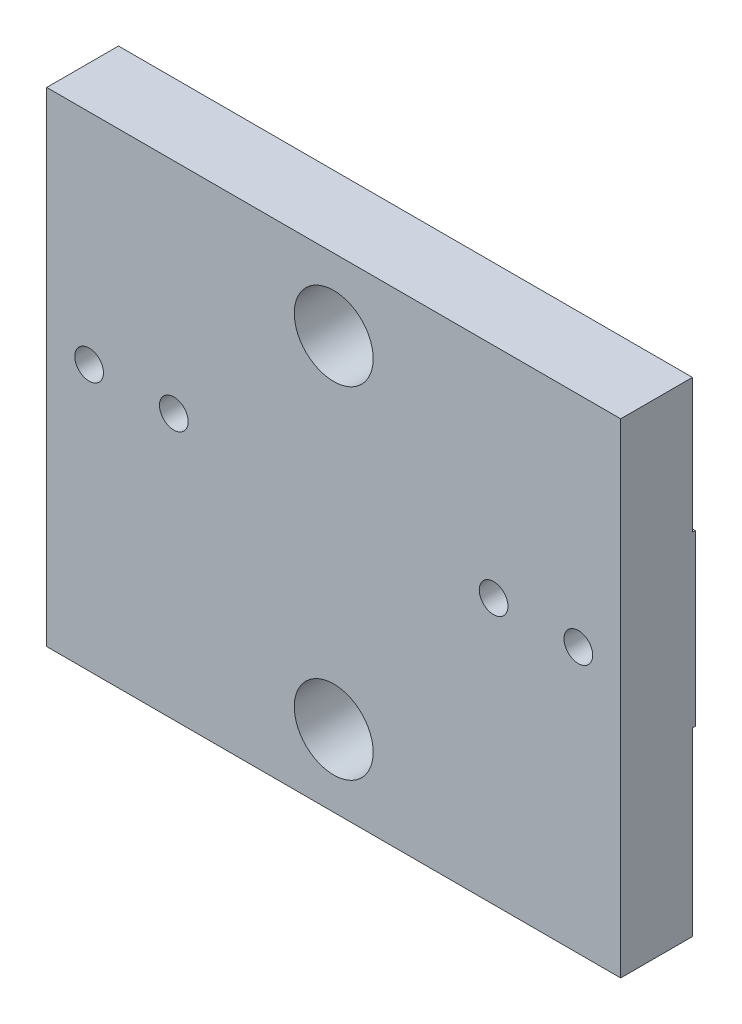
ISO-10303-21;
HEADER;
FILE_DESCRIPTION(('STEP AP214'),'2;1');
FILE_NAME('part.step','',(''),(''),'','','');
FILE_SCHEMA(('AUTOMOTIVE_DESIGN { 1 0 10303 214 1 1 1 1 }'));
ENDSEC;
DATA;
#1=APPLICATION_CONTEXT('core data for automotive mechanical design processes');
#2=APPLICATION_PROTOCOL_DEFINITION('international standard','automotive_design',2000,#1);
#3=PRODUCT_CONTEXT('',#1,'mechanical');
#4=PRODUCT('Part','Part','',(#3));
#5=PRODUCT_RELATED_PRODUCT_CATEGORY('part','',(#4));
#6=PRODUCT_DEFINITION_FORMATION('','',#4);
#7=PRODUCT_DEFINITION_CONTEXT('part definition',#1,'design');
#8=PRODUCT_DEFINITION('design','',#6,#7);
#9=PRODUCT_DEFINITION_SHAPE('','',#8);
#10=(LENGTH_UNIT() NAMED_UNIT(*) SI_UNIT(.MILLI.,.METRE.));
#11=(NAMED_UNIT(*) PLANE_ANGLE_UNIT() SI_UNIT($,.RADIAN.));
#12=(NAMED_UNIT(*) SI_UNIT($,.STERADIAN.) SOLID_ANGLE_UNIT());
#13=UNCERTAINTY_MEASURE_WITH_UNIT(LENGTH_MEASURE(1.E-05),#10,'distance_accuracy_value','');
#14=(GEOMETRIC_REPRESENTATION_CONTEXT(3) GLOBAL_UNCERTAINTY_ASSIGNED_CONTEXT((#13)) GLOBAL_UNIT_ASSIGNED_CONTEXT((#10,
#11,#12)) REPRESENTATION_CONTEXT('',''));
#15=CARTESIAN_POINT('',(0.,0.,0.));
#16=DIRECTION('',(0.,0.,1.));
#17=DIRECTION('',(1.,0.,0.));
#18=AXIS2_PLACEMENT_3D('',#15,#16,#17);
#19=CARTESIAN_POINT('',(0.,0.,0.));
#20=DIRECTION('',(0.,0.,-1.));
#21=DIRECTION('',(-1.,0.,0.));
#22=AXIS2_PLACEMENT_3D('',#19,#20,#21);
#23=PLANE('',#22);
#24=DIRECTION('',(1.,0.,0.));
#25=VECTOR('',#24,1.);
#26=CARTESIAN_POINT('',(-8.66,4.9255,0.));
#27=LINE('',#26,#25);
#28=CARTESIAN_POINT('',(-8.66,4.9255,0.));
#29=VERTEX_POINT('',#28);
#30=CARTESIAN_POINT('',(-7.16,4.9255,0.));
#31=VERTEX_POINT('',#30);
#32=EDGE_CURVE('E86',#29,#31,#27,.T.);
#33=ORIENTED_EDGE('',*,*,#32,.F.);
#34=DIRECTION('',(0.,1.,0.));
#35=VECTOR('',#34,1.);
#36=CARTESIAN_POINT('',(-8.66,4.5255,0.));
#37=LINE('',#36,#35);
#38=CARTESIAN_POINT('',(-8.66,4.5255,0.));
#39=VERTEX_POINT('',#38);
#40=EDGE_CURVE('E349',#39,#29,#37,.T.);
#41=ORIENTED_EDGE('',*,*,#40,.F.);
#42=DIRECTION('',(1.,0.,0.));
#43=VECTOR('',#42,1.);
#44=CARTESIAN_POINT('',(-8.66,4.5255,0.));
#45=LINE('',#44,#43);
#46=CARTESIAN_POINT('',(-7.16,4.5255,0.));
#47=VERTEX_POINT('',#46);
#48=EDGE_CURVE('E343',#39,#47,#45,.T.);
#49=ORIENTED_EDGE('',*,*,#48,.T.);
#50=DIRECTION('',(0.,1.,0.));
#51=VECTOR('',#50,1.);
#52=CARTESIAN_POINT('',(-7.16,4.5255,0.));
#53=LINE('',#52,#51);
#54=EDGE_CURVE('E345',#47,#31,#53,.T.);
#55=ORIENTED_EDGE('',*,*,#54,.T.);
#56=EDGE_LOOP('',(#33,#41,#49,#55));
#57=FACE_BOUND('',#56,.T.);
#58=CARTESIAN_POINT('',(-5.66,0.825500000000002,0.));
#59=DIRECTION('',(0.,0.,-1.));
#60=DIRECTION('',(-1.,0.,0.));
#61=AXIS2_PLACEMENT_3D('',#58,#59,#60);
#62=CIRCLE('',#61,1.008);
#63=CARTESIAN_POINT('',(-6.668,0.825500000000002,0.));
#64=VERTEX_POINT('',#63);
#65=EDGE_CURVE('E12',#64,#64,#62,.T.);
#66=ORIENTED_EDGE('',*,*,#65,.F.);
#67=EDGE_LOOP('',(#66));
#68=FACE_BOUND('',#67,.T.);
#69=CARTESIAN_POINT('',(5.66000000000001,0.825500000000005,0.));
#70=DIRECTION('',(0.,0.,-1.));
#71=DIRECTION('',(-1.,0.,0.));
#72=AXIS2_PLACEMENT_3D('',#69,#70,#71);
#73=CIRCLE('',#72,1.008);
#74=CARTESIAN_POINT('',(4.65200000000001,0.825500000000005,0.));
#75=VERTEX_POINT('',#74);
#76=EDGE_CURVE('E71',#75,#75,#73,.T.);
#77=ORIENTED_EDGE('',*,*,#76,.F.);
#78=EDGE_LOOP('',(#77));
#79=FACE_BOUND('',#78,.T.);
#80=CARTESIAN_POINT('',(0.,-6.0325,0.));
#81=DIRECTION('',(0.,0.,1.));
#82=DIRECTION('',(1.,0.,0.));
#83=AXIS2_PLACEMENT_3D('',#80,#81,#82);
#84=CIRCLE('',#83,1.397);
#85=CARTESIAN_POINT('',(1.397,-6.0325,0.));
#86=VERTEX_POINT('',#85);
#87=EDGE_CURVE('E490',#86,#86,#84,.T.);
#88=ORIENTED_EDGE('',*,*,#87,.T.);
#89=EDGE_LOOP('',(#88));
#90=FACE_BOUND('',#89,.T.);
#91=CARTESIAN_POINT('',(0.,6.0325,0.));
#92=DIRECTION('',(0.,0.,1.));
#93=DIRECTION('',(1.,0.,0.));
#94=AXIS2_PLACEMENT_3D('',#91,#92,#93);
#95=CIRCLE('',#94,1.397);
#96=CARTESIAN_POINT('',(1.397,6.0325,0.));
#97=VERTEX_POINT('',#96);
#98=EDGE_CURVE('E496',#97,#97,#95,.T.);
#99=ORIENTED_EDGE('',*,*,#98,.T.);
#100=EDGE_LOOP('',(#99));
#101=FACE_BOUND('',#100,.T.);
#102=DIRECTION('',(0.,-1.,0.));
#103=VECTOR('',#102,1.);
#104=CARTESIAN_POINT('',(-7.16,0.,0.));
#105=LINE('',#104,#103);
#106=CARTESIAN_POINT('',(-7.16,3.8255,0.));
#107=VERTEX_POINT('',#106);
#108=CARTESIAN_POINT('',(-7.16,-2.1745,0.));
#109=VERTEX_POINT('',#108);
#110=EDGE_CURVE('E386',#107,#109,#105,.T.);
#111=ORIENTED_EDGE('',*,*,#110,.F.);
#112=DIRECTION('',(1.,0.,0.));
#113=VECTOR('',#112,1.);
#114=CARTESIAN_POINT('',(0.,3.8255,0.));
#115=LINE('',#114,#113);
#116=CARTESIAN_POINT('',(-10.16,3.8255,0.));
#117=VERTEX_POINT('',#116);
#118=EDGE_CURVE('E384',#117,#107,#115,.T.);
#119=ORIENTED_EDGE('',*,*,#118,.F.);
#120=DIRECTION('',(0.,-1.,0.));
#121=VECTOR('',#120,1.);
#122=CARTESIAN_POINT('',(-10.16,-8.5725,0.));
#123=LINE('',#122,#121);
#124=CARTESIAN_POINT('',(-10.16,8.5725,0.));
#125=VERTEX_POINT('',#124);
#126=EDGE_CURVE('E477',#125,#117,#123,.T.);
#127=ORIENTED_EDGE('',*,*,#126,.F.);
#128=DIRECTION('',(-1.,0.,0.));
#129=VECTOR('',#128,1.);
#130=CARTESIAN_POINT('',(-10.16,8.5725,0.));
#131=LINE('',#130,#129);
#132=CARTESIAN_POINT('',(10.16,8.5725,0.));
#133=VERTEX_POINT('',#132);
#134=EDGE_CURVE('E447',#133,#125,#131,.T.);
#135=ORIENTED_EDGE('',*,*,#134,.F.);
#136=DIRECTION('',(0.,1.,0.));
#137=VECTOR('',#136,1.);
#138=CARTESIAN_POINT('',(10.16,-8.5725,0.));
#139=LINE('',#138,#137);
#140=CARTESIAN_POINT('',(10.16,3.8255,0.));
#141=VERTEX_POINT('',#140);
#142=EDGE_CURVE('E448',#141,#133,#139,.T.);
#143=ORIENTED_EDGE('',*,*,#142,.F.);
#144=DIRECTION('',(-1.,0.,0.));
#145=VECTOR('',#144,1.);
#146=CARTESIAN_POINT('',(0.,3.8255,0.));
#147=LINE('',#146,#145);
#148=CARTESIAN_POINT('',(7.16,3.8255,0.));
#149=VERTEX_POINT('',#148);
#150=EDGE_CURVE('E426',#141,#149,#147,.T.);
#151=ORIENTED_EDGE('',*,*,#150,.T.);
#152=DIRECTION('',(0.,-1.,0.));
#153=VECTOR('',#152,1.);
#154=CARTESIAN_POINT('',(7.16000000000001,0.,0.));
#155=LINE('',#154,#153);
#156=CARTESIAN_POINT('',(7.16000000000001,-2.1745,0.));
#157=VERTEX_POINT('',#156);
#158=EDGE_CURVE('E407',#149,#157,#155,.T.);
#159=ORIENTED_EDGE('',*,*,#158,.T.);
#160=DIRECTION('',(1.,0.,0.));
#161=VECTOR('',#160,1.);
#162=CARTESIAN_POINT('',(0.,-2.1745,0.));
#163=LINE('',#162,#161);
#164=CARTESIAN_POINT('',(10.16,-2.1745,0.));
#165=VERTEX_POINT('',#164);
#166=EDGE_CURVE('E392',#157,#165,#163,.T.);
#167=ORIENTED_EDGE('',*,*,#166,.T.);
#168=CARTESIAN_POINT('',(10.16,-8.5725,0.));
#169=VERTEX_POINT('',#168);
#170=EDGE_CURVE('E443',#169,#165,#139,.T.);
#171=ORIENTED_EDGE('',*,*,#170,.F.);
#172=DIRECTION('',(1.,0.,0.));
#173=VECTOR('',#172,1.);
#174=CARTESIAN_POINT('',(-10.16,-8.5725,0.));
#175=LINE('',#174,#173);
#176=CARTESIAN_POINT('',(-10.16,-8.5725,0.));
#177=VERTEX_POINT('',#176);
#178=EDGE_CURVE('E453',#177,#169,#175,.T.);
#179=ORIENTED_EDGE('',*,*,#178,.F.);
#180=CARTESIAN_POINT('',(-10.16,-2.1745,0.));
#181=VERTEX_POINT('',#180);
#182=EDGE_CURVE('E480',#181,#177,#123,.T.);
#183=ORIENTED_EDGE('',*,*,#182,.F.);
#184=DIRECTION('',(-1.,0.,0.));
#185=VECTOR('',#184,1.);
#186=CARTESIAN_POINT('',(0.,-2.1745,0.));
#187=LINE('',#186,#185);
#188=EDGE_CURVE('E389',#109,#181,#187,.T.);
#189=ORIENTED_EDGE('',*,*,#188,.F.);
#190=EDGE_LOOP('',(#111,#119,#127,#135,#143,#151,#159,#167,#171,#179,#183,#189));
#191=FACE_BOUND('',#190,.T.);
#192=DIRECTION('',(1.,0.,0.));
#193=VECTOR('',#192,1.);
#194=CARTESIAN_POINT('',(7.71000000000001,5.427382862635,0.));
#195=LINE('',#194,#193);
#196=CARTESIAN_POINT('',(7.71000000000001,5.427382862635,0.));
#197=VERTEX_POINT('',#196);
#198=CARTESIAN_POINT('',(8.11000000000001,5.427382862635,0.));
#199=VERTEX_POINT('',#198);
#200=EDGE_CURVE('E259',#197,#199,#195,.T.);
#201=ORIENTED_EDGE('',*,*,#200,.F.);
#202=DIRECTION('',(0.,1.,0.));
#203=VECTOR('',#202,1.);
#204=CARTESIAN_POINT('',(7.71000000000001,4.03786518942795,0.));
#205=LINE('',#204,#203);
#206=CARTESIAN_POINT('',(7.71000000000001,4.9255,0.));
#207=VERTEX_POINT('',#206);
#208=EDGE_CURVE('E248',#207,#197,#205,.T.);
#209=ORIENTED_EDGE('',*,*,#208,.F.);
#210=DIRECTION('',(1.,0.,0.));
#211=VECTOR('',#210,1.);
#212=CARTESIAN_POINT('',(7.16,4.9255,0.));
#213=LINE('',#212,#211);
#214=CARTESIAN_POINT('',(7.16,4.9255,0.));
#215=VERTEX_POINT('',#214);
#216=EDGE_CURVE('E310',#215,#207,#213,.T.);
#217=ORIENTED_EDGE('',*,*,#216,.F.);
#218=DIRECTION('',(0.,1.,0.));
#219=VECTOR('',#218,1.);
#220=CARTESIAN_POINT('',(7.16,4.5255,0.));
#221=LINE('',#220,#219);
#222=CARTESIAN_POINT('',(7.16,4.5255,0.));
#223=VERTEX_POINT('',#222);
#224=EDGE_CURVE('E308',#223,#215,#221,.T.);
#225=ORIENTED_EDGE('',*,*,#224,.F.);
#226=DIRECTION('',(1.,0.,0.));
#227=VECTOR('',#226,1.);
#228=CARTESIAN_POINT('',(7.16,4.5255,0.));
#229=LINE('',#228,#227);
#230=CARTESIAN_POINT('',(7.71000000000001,4.5255,0.));
#231=VERTEX_POINT('',#230);
#232=EDGE_CURVE('E317',#223,#231,#229,.T.);
#233=ORIENTED_EDGE('',*,*,#232,.T.);
#234=CARTESIAN_POINT('',(7.71000000000001,4.03786518942795,0.));
#235=VERTEX_POINT('',#234);
#236=EDGE_CURVE('E260',#235,#231,#205,.T.);
#237=ORIENTED_EDGE('',*,*,#236,.F.);
#238=DIRECTION('',(1.,0.,0.));
#239=VECTOR('',#238,1.);
#240=CARTESIAN_POINT('',(7.71000000000001,4.03786518942795,0.));
#241=LINE('',#240,#239);
#242=CARTESIAN_POINT('',(8.11000000000001,4.03786518942795,0.));
#243=VERTEX_POINT('',#242);
#244=EDGE_CURVE('E78',#235,#243,#241,.T.);
#245=ORIENTED_EDGE('',*,*,#244,.T.);
#246=DIRECTION('',(0.,1.,0.));
#247=VECTOR('',#246,1.);
#248=CARTESIAN_POINT('',(8.11000000000001,4.03786518942795,0.));
#249=LINE('',#248,#247);
#250=CARTESIAN_POINT('',(8.11000000000001,4.5255,0.));
#251=VERTEX_POINT('',#250);
#252=EDGE_CURVE('E275',#243,#251,#249,.T.);
#253=ORIENTED_EDGE('',*,*,#252,.T.);
#254=CARTESIAN_POINT('',(8.66,4.5255,0.));
#255=VERTEX_POINT('',#254);
#256=EDGE_CURVE('E320',#251,#255,#229,.T.);
#257=ORIENTED_EDGE('',*,*,#256,.T.);
#258=DIRECTION('',(0.,1.,0.));
#259=VECTOR('',#258,1.);
#260=CARTESIAN_POINT('',(8.66,4.5255,0.));
#261=LINE('',#260,#259);
#262=CARTESIAN_POINT('',(8.66,4.9255,0.));
#263=VERTEX_POINT('',#262);
#264=EDGE_CURVE('E314',#255,#263,#261,.T.);
#265=ORIENTED_EDGE('',*,*,#264,.T.);
#266=CARTESIAN_POINT('',(8.11000000000001,4.9255,0.));
#267=VERTEX_POINT('',#266);
#268=EDGE_CURVE('E313',#267,#263,#213,.T.);
#269=ORIENTED_EDGE('',*,*,#268,.F.);
#270=EDGE_CURVE('E274',#267,#199,#249,.T.);
#271=ORIENTED_EDGE('',*,*,#270,.T.);
#272=EDGE_LOOP('',(#201,#209,#217,#225,#233,#237,#245,#253,#257,#265,#269,#271));
#273=FACE_BOUND('',#272,.T.);
#274=ADVANCED_FACE('F63',(#57,#68,#79,#90,#101,#191,#273),#23,.T.);
#275=CARTESIAN_POINT('',(0.,0.,2.54));
#276=DIRECTION('',(0.,0.,-1.));
#277=DIRECTION('',(-1.,0.,0.));
#278=AXIS2_PLACEMENT_3D('',#275,#276,#277);
#279=PLANE('',#278);
#280=CARTESIAN_POINT('',(-5.66,0.825500000000002,2.54));
#281=DIRECTION('',(0.,0.,1.));
#282=DIRECTION('',(1.,0.,0.));
#283=AXIS2_PLACEMENT_3D('',#280,#281,#282);
#284=CIRCLE('',#283,0.508);
#285=CARTESIAN_POINT('',(-5.152,0.825500000000002,2.54));
#286=VERTEX_POINT('',#285);
#287=EDGE_CURVE('E507',#286,#286,#284,.T.);
#288=ORIENTED_EDGE('',*,*,#287,.F.);
#289=EDGE_LOOP('',(#288));
#290=FACE_BOUND('',#289,.T.);
#291=CARTESIAN_POINT('',(-8.66,0.8255,2.54));
#292=DIRECTION('',(0.,0.,1.));
#293=DIRECTION('',(1.,0.,0.));
#294=AXIS2_PLACEMENT_3D('',#291,#292,#293);
#295=CIRCLE('',#294,0.508);
#296=CARTESIAN_POINT('',(-8.152,0.8255,2.54));
#297=VERTEX_POINT('',#296);
#298=EDGE_CURVE('E499',#297,#297,#295,.T.);
#299=ORIENTED_EDGE('',*,*,#298,.F.);
#300=EDGE_LOOP('',(#299));
#301=FACE_BOUND('',#300,.T.);
#302=CARTESIAN_POINT('',(0.,-6.0325,2.54));
#303=DIRECTION('',(0.,0.,1.));
#304=DIRECTION('',(1.,0.,0.));
#305=AXIS2_PLACEMENT_3D('',#302,#303,#304);
#306=CIRCLE('',#305,1.397);
#307=CARTESIAN_POINT('',(1.397,-6.0325,2.54));
#308=VERTEX_POINT('',#307);
#309=EDGE_CURVE('E481',#308,#308,#306,.T.);
#310=ORIENTED_EDGE('',*,*,#309,.F.);
#311=EDGE_LOOP('',(#310));
#312=FACE_BOUND('',#311,.T.);
#313=DIRECTION('',(0.,-1.,0.));
#314=VECTOR('',#313,1.);
#315=CARTESIAN_POINT('',(-10.16,-8.5725,2.54));
#316=LINE('',#315,#314);
#317=CARTESIAN_POINT('',(-10.16,8.5725,2.54));
#318=VERTEX_POINT('',#317);
#319=CARTESIAN_POINT('',(-10.16,-8.5725,2.54));
#320=VERTEX_POINT('',#319);
#321=EDGE_CURVE('E457',#318,#320,#316,.T.);
#322=ORIENTED_EDGE('',*,*,#321,.T.);
#323=DIRECTION('',(1.,0.,0.));
#324=VECTOR('',#323,1.);
#325=CARTESIAN_POINT('',(-10.16,-8.5725,2.54));
#326=LINE('',#325,#324);
#327=CARTESIAN_POINT('',(10.16,-8.5725,2.54));
#328=VERTEX_POINT('',#327);
#329=EDGE_CURVE('E486',#320,#328,#326,.T.);
#330=ORIENTED_EDGE('',*,*,#329,.T.);
#331=DIRECTION('',(0.,1.,0.));
#332=VECTOR('',#331,1.);
#333=CARTESIAN_POINT('',(10.16,-8.5725,2.54));
#334=LINE('',#333,#332);
#335=CARTESIAN_POINT('',(10.16,8.5725,2.54));
#336=VERTEX_POINT('',#335);
#337=EDGE_CURVE('E484',#328,#336,#334,.T.);
#338=ORIENTED_EDGE('',*,*,#337,.T.);
#339=DIRECTION('',(-1.,0.,0.));
#340=VECTOR('',#339,1.);
#341=CARTESIAN_POINT('',(-10.16,8.5725,2.54));
#342=LINE('',#341,#340);
#343=EDGE_CURVE('E460',#336,#318,#342,.T.);
#344=ORIENTED_EDGE('',*,*,#343,.T.);
#345=EDGE_LOOP('',(#322,#330,#338,#344));
#346=FACE_BOUND('',#345,.T.);
#347=CARTESIAN_POINT('',(0.,6.0325,2.54));
#348=DIRECTION('',(0.,0.,1.));
#349=DIRECTION('',(1.,0.,0.));
#350=AXIS2_PLACEMENT_3D('',#347,#348,#349);
#351=CIRCLE('',#350,1.397);
#352=CARTESIAN_POINT('',(1.397,6.0325,2.54));
#353=VERTEX_POINT('',#352);
#354=EDGE_CURVE('E493',#353,#353,#351,.T.);
#355=ORIENTED_EDGE('',*,*,#354,.F.);
#356=EDGE_LOOP('',(#355));
#357=FACE_BOUND('',#356,.T.);
#358=CARTESIAN_POINT('',(8.66000000000001,0.825500000000002,2.54));
#359=DIRECTION('',(0.,0.,1.));
#360=DIRECTION('',(-1.,0.,0.));
#361=AXIS2_PLACEMENT_3D('',#358,#359,#360);
#362=CIRCLE('',#361,0.508);
#363=CARTESIAN_POINT('',(8.15200000000001,0.825500000000002,2.54));
#364=VERTEX_POINT('',#363);
#365=EDGE_CURVE('E504',#364,#364,#362,.T.);
#366=ORIENTED_EDGE('',*,*,#365,.F.);
#367=EDGE_LOOP('',(#366));
#368=FACE_BOUND('',#367,.T.);
#369=CARTESIAN_POINT('',(5.66000000000001,0.825500000000005,2.54));
#370=DIRECTION('',(0.,0.,1.));
#371=DIRECTION('',(-1.,0.,0.));
#372=AXIS2_PLACEMENT_3D('',#369,#370,#371);
#373=CIRCLE('',#372,0.508);
#374=CARTESIAN_POINT('',(5.15200000000001,0.825500000000005,2.54));
#375=VERTEX_POINT('',#374);
#376=EDGE_CURVE('E510',#375,#375,#373,.T.);
#377=ORIENTED_EDGE('',*,*,#376,.F.);
#378=EDGE_LOOP('',(#377));
#379=FACE_BOUND('',#378,.T.);
#380=ADVANCED_FACE('F552',(#290,#301,#312,#346,#357,#368,#379),#279,.F.);
#381=CARTESIAN_POINT('',(-10.16,-8.5725,2.54));
#382=DIRECTION('',(1.,0.,0.));
#383=DIRECTION('',(0.,1.,0.));
#384=AXIS2_PLACEMENT_3D('',#381,#382,#383);
#385=PLANE('',#384);
#386=ORIENTED_EDGE('',*,*,#126,.T.);
#387=DIRECTION('',(0.,0.,1.));
#388=VECTOR('',#387,1.);
#389=CARTESIAN_POINT('',(-10.16,3.8255,-0.1));
#390=LINE('',#389,#388);
#391=CARTESIAN_POINT('',(-10.16,3.8255,-0.1));
#392=VERTEX_POINT('',#391);
#393=EDGE_CURVE('E373',#392,#117,#390,.T.);
#394=ORIENTED_EDGE('',*,*,#393,.F.);
#395=DIRECTION('',(0.,1.,0.));
#396=VECTOR('',#395,1.);
#397=CARTESIAN_POINT('',(-10.16,0.,-0.1));
#398=LINE('',#397,#396);
#399=CARTESIAN_POINT('',(-10.16,-2.1745,-0.1));
#400=VERTEX_POINT('',#399);
#401=EDGE_CURVE('E398',#400,#392,#398,.T.);
#402=ORIENTED_EDGE('',*,*,#401,.F.);
#403=DIRECTION('',(0.,0.,1.));
#404=VECTOR('',#403,1.);
#405=CARTESIAN_POINT('',(-10.16,-2.1745,-0.1));
#406=LINE('',#405,#404);
#407=EDGE_CURVE('E374',#400,#181,#406,.T.);
#408=ORIENTED_EDGE('',*,*,#407,.T.);
#409=ORIENTED_EDGE('',*,*,#182,.T.);
#410=DIRECTION('',(0.,0.,-1.));
#411=VECTOR('',#410,1.);
#412=CARTESIAN_POINT('',(-10.16,-8.5725,2.54));
#413=LINE('',#412,#411);
#414=EDGE_CURVE('E430',#320,#177,#413,.T.);
#415=ORIENTED_EDGE('',*,*,#414,.F.);
#416=ORIENTED_EDGE('',*,*,#321,.F.);
#417=DIRECTION('',(0.,0.,-1.));
#418=VECTOR('',#417,1.);
#419=CARTESIAN_POINT('',(-10.16,8.5725,2.54));
#420=LINE('',#419,#418);
#421=EDGE_CURVE('E458',#318,#125,#420,.T.);
#422=ORIENTED_EDGE('',*,*,#421,.T.);
#423=EDGE_LOOP('',(#386,#394,#402,#408,#409,#415,#416,#422));
#424=FACE_BOUND('',#423,.T.);
#425=ADVANCED_FACE('F65',(#424),#385,.F.);
#426=CARTESIAN_POINT('',(-10.16,-8.5725,2.54));
#427=DIRECTION('',(0.,1.,0.));
#428=DIRECTION('',(0.,0.,1.));
#429=AXIS2_PLACEMENT_3D('',#426,#427,#428);
#430=PLANE('',#429);
#431=ORIENTED_EDGE('',*,*,#178,.T.);
#432=DIRECTION('',(0.,0.,-1.));
#433=VECTOR('',#432,1.);
#434=CARTESIAN_POINT('',(10.16,-8.5725,2.54));
#435=LINE('',#434,#433);
#436=EDGE_CURVE('E434',#328,#169,#435,.T.);
#437=ORIENTED_EDGE('',*,*,#436,.F.);
#438=ORIENTED_EDGE('',*,*,#329,.F.);
#439=ORIENTED_EDGE('',*,*,#414,.T.);
#440=EDGE_LOOP('',(#431,#437,#438,#439));
#441=FACE_BOUND('',#440,.T.);
#442=ADVANCED_FACE('F566',(#441),#430,.F.);
#443=CARTESIAN_POINT('',(10.16,-8.5725,2.54));
#444=DIRECTION('',(-1.,0.,0.));
#445=DIRECTION('',(0.,-1.,0.));
#446=AXIS2_PLACEMENT_3D('',#443,#444,#445);
#447=PLANE('',#446);
#448=ORIENTED_EDGE('',*,*,#170,.T.);
#449=DIRECTION('',(0.,0.,1.));
#450=VECTOR('',#449,1.);
#451=CARTESIAN_POINT('',(10.16,-2.1745,-0.1));
#452=LINE('',#451,#450);
#453=CARTESIAN_POINT('',(10.16,-2.1745,-0.1));
#454=VERTEX_POINT('',#453);
#455=EDGE_CURVE('E419',#454,#165,#452,.T.);
#456=ORIENTED_EDGE('',*,*,#455,.F.);
#457=DIRECTION('',(0.,1.,0.));
#458=VECTOR('',#457,1.);
#459=CARTESIAN_POINT('',(10.16,0.,-0.1));
#460=LINE('',#459,#458);
#461=CARTESIAN_POINT('',(10.16,3.8255,-0.1));
#462=VERTEX_POINT('',#461);
#463=EDGE_CURVE('E410',#454,#462,#460,.T.);
#464=ORIENTED_EDGE('',*,*,#463,.T.);
#465=DIRECTION('',(0.,0.,1.));
#466=VECTOR('',#465,1.);
#467=CARTESIAN_POINT('',(10.16,3.8255,-0.1));
#468=LINE('',#467,#466);
#469=EDGE_CURVE('E515',#462,#141,#468,.T.);
#470=ORIENTED_EDGE('',*,*,#469,.T.);
#471=ORIENTED_EDGE('',*,*,#142,.T.);
#472=DIRECTION('',(0.,0.,-1.));
#473=VECTOR('',#472,1.);
#474=CARTESIAN_POINT('',(10.16,8.5725,2.54));
#475=LINE('',#474,#473);
#476=EDGE_CURVE('E439',#336,#133,#475,.T.);
#477=ORIENTED_EDGE('',*,*,#476,.F.);
#478=ORIENTED_EDGE('',*,*,#337,.F.);
#479=ORIENTED_EDGE('',*,*,#436,.T.);
#480=EDGE_LOOP('',(#448,#456,#464,#470,#471,#477,#478,#479));
#481=FACE_BOUND('',#480,.T.);
#482=ADVANCED_FACE('F531',(#481),#447,.F.);
#483=CARTESIAN_POINT('',(-10.16,8.5725,2.54));
#484=DIRECTION('',(0.,-1.,0.));
#485=DIRECTION('',(0.,0.,-1.));
#486=AXIS2_PLACEMENT_3D('',#483,#484,#485);
#487=PLANE('',#486);
#488=ORIENTED_EDGE('',*,*,#134,.T.);
#489=ORIENTED_EDGE('',*,*,#421,.F.);
#490=ORIENTED_EDGE('',*,*,#343,.F.);
#491=ORIENTED_EDGE('',*,*,#476,.T.);
#492=EDGE_LOOP('',(#488,#489,#490,#491));
#493=FACE_BOUND('',#492,.T.);
#494=ADVANCED_FACE('F466',(#493),#487,.F.);
#495=CARTESIAN_POINT('',(0.,-6.0325,2.54));
#496=DIRECTION('',(0.,0.,-1.));
#497=DIRECTION('',(-1.,0.,0.));
#498=AXIS2_PLACEMENT_3D('',#495,#496,#497);
#499=CYLINDRICAL_SURFACE('',#498,1.397);
#500=ORIENTED_EDGE('',*,*,#309,.T.);
#501=EDGE_LOOP('',(#500));
#502=FACE_BOUND('',#501,.T.);
#503=ORIENTED_EDGE('',*,*,#87,.F.);
#504=EDGE_LOOP('',(#503));
#505=FACE_BOUND('',#504,.T.);
#506=ADVANCED_FACE('F564',(#502,#505),#499,.F.);
#507=CARTESIAN_POINT('',(0.,6.0325,2.54));
#508=DIRECTION('',(0.,0.,-1.));
#509=DIRECTION('',(-1.,0.,0.));
#510=AXIS2_PLACEMENT_3D('',#507,#508,#509);
#511=CYLINDRICAL_SURFACE('',#510,1.397);
#512=ORIENTED_EDGE('',*,*,#354,.T.);
#513=EDGE_LOOP('',(#512));
#514=FACE_BOUND('',#513,.T.);
#515=ORIENTED_EDGE('',*,*,#98,.F.);
#516=EDGE_LOOP('',(#515));
#517=FACE_BOUND('',#516,.T.);
#518=ADVANCED_FACE('F896',(#514,#517),#511,.F.);
#519=CARTESIAN_POINT('',(-8.66,0.8255,2.54));
#520=DIRECTION('',(0.,0.,-1.));
#521=DIRECTION('',(-1.,0.,0.));
#522=AXIS2_PLACEMENT_3D('',#519,#520,#521);
#523=CYLINDRICAL_SURFACE('',#522,0.508);
#524=ORIENTED_EDGE('',*,*,#298,.T.);
#525=EDGE_LOOP('',(#524));
#526=FACE_BOUND('',#525,.T.);
#527=CARTESIAN_POINT('',(-8.66,0.8255,-0.1));
#528=DIRECTION('',(0.,0.,1.));
#529=DIRECTION('',(1.,0.,0.));
#530=AXIS2_PLACEMENT_3D('',#527,#528,#529);
#531=CIRCLE('',#530,0.508);
#532=CARTESIAN_POINT('',(-8.152,0.8255,-0.1));
#533=VERTEX_POINT('',#532);
#534=EDGE_CURVE('E387',#533,#533,#531,.T.);
#535=ORIENTED_EDGE('',*,*,#534,.F.);
#536=EDGE_LOOP('',(#535));
#537=FACE_BOUND('',#536,.T.);
#538=ADVANCED_FACE('F898',(#526,#537),#523,.F.);
#539=CARTESIAN_POINT('',(8.66000000000001,0.825500000000002,2.54));
#540=DIRECTION('',(0.,0.,-1.));
#541=DIRECTION('',(-1.,0.,0.));
#542=AXIS2_PLACEMENT_3D('',#539,#540,#541);
#543=CYLINDRICAL_SURFACE('',#542,0.508);
#544=ORIENTED_EDGE('',*,*,#365,.T.);
#545=EDGE_LOOP('',(#544));
#546=FACE_BOUND('',#545,.T.);
#547=CARTESIAN_POINT('',(8.66000000000001,0.825500000000002,-0.1));
#548=DIRECTION('',(0.,0.,1.));
#549=DIRECTION('',(1.,0.,0.));
#550=AXIS2_PLACEMENT_3D('',#547,#548,#549);
#551=CIRCLE('',#550,0.508);
#552=CARTESIAN_POINT('',(9.16800000000001,0.825500000000002,-0.1));
#553=VERTEX_POINT('',#552);
#554=EDGE_CURVE('E403',#553,#553,#551,.T.);
#555=ORIENTED_EDGE('',*,*,#554,.F.);
#556=EDGE_LOOP('',(#555));
#557=FACE_BOUND('',#556,.T.);
#558=ADVANCED_FACE('F905',(#546,#557),#543,.F.);
#559=CARTESIAN_POINT('',(-5.66,0.825500000000002,2.54));
#560=DIRECTION('',(0.,0.,-1.));
#561=DIRECTION('',(-1.,0.,0.));
#562=AXIS2_PLACEMENT_3D('',#559,#560,#561);
#563=CYLINDRICAL_SURFACE('',#562,0.508);
#564=ORIENTED_EDGE('',*,*,#287,.T.);
#565=EDGE_LOOP('',(#564));
#566=FACE_BOUND('',#565,.T.);
#567=CARTESIAN_POINT('',(-5.66,0.825500000000002,-0.1));
#568=DIRECTION('',(0.,0.,1.));
#569=DIRECTION('',(1.,0.,0.));
#570=AXIS2_PLACEMENT_3D('',#567,#568,#569);
#571=CIRCLE('',#570,0.508);
#572=CARTESIAN_POINT('',(-5.152,0.825500000000002,-0.1));
#573=VERTEX_POINT('',#572);
#574=EDGE_CURVE('E364',#573,#573,#571,.T.);
#575=ORIENTED_EDGE('',*,*,#574,.F.);
#576=EDGE_LOOP('',(#575));
#577=FACE_BOUND('',#576,.T.);
#578=ADVANCED_FACE('F547',(#566,#577),#563,.F.);
#579=CARTESIAN_POINT('',(5.66000000000001,0.825500000000005,2.54));
#580=DIRECTION('',(0.,0.,-1.));
#581=DIRECTION('',(-1.,0.,0.));
#582=AXIS2_PLACEMENT_3D('',#579,#580,#581);
#583=CYLINDRICAL_SURFACE('',#582,0.508);
#584=ORIENTED_EDGE('',*,*,#376,.T.);
#585=EDGE_LOOP('',(#584));
#586=FACE_BOUND('',#585,.T.);
#587=CARTESIAN_POINT('',(5.66000000000001,0.825500000000005,-0.1));
#588=DIRECTION('',(0.,0.,1.));
#589=DIRECTION('',(1.,0.,0.));
#590=AXIS2_PLACEMENT_3D('',#587,#588,#589);
#591=CIRCLE('',#590,0.508);
#592=CARTESIAN_POINT('',(6.16800000000001,0.825500000000005,-0.1));
#593=VERTEX_POINT('',#592);
#594=EDGE_CURVE('E370',#593,#593,#591,.T.);
#595=ORIENTED_EDGE('',*,*,#594,.F.);
#596=EDGE_LOOP('',(#595));
#597=FACE_BOUND('',#596,.T.);
#598=ADVANCED_FACE('F540',(#586,#597),#583,.F.);
#599=CARTESIAN_POINT('',(0.,-2.1745,-0.1));
#600=DIRECTION('',(0.,-1.,0.));
#601=DIRECTION('',(0.,0.,-1.));
#602=AXIS2_PLACEMENT_3D('',#599,#600,#601);
#603=PLANE('',#602);
#604=ORIENTED_EDGE('',*,*,#166,.F.);
#605=DIRECTION('',(0.,0.,1.));
#606=VECTOR('',#605,1.);
#607=CARTESIAN_POINT('',(7.16000000000001,-2.1745,-0.1));
#608=LINE('',#607,#606);
#609=CARTESIAN_POINT('',(7.16000000000001,-2.1745,-0.1));
#610=VERTEX_POINT('',#609);
#611=EDGE_CURVE('E513',#610,#157,#608,.T.);
#612=ORIENTED_EDGE('',*,*,#611,.F.);
#613=DIRECTION('',(1.,0.,0.));
#614=VECTOR('',#613,1.);
#615=CARTESIAN_POINT('',(0.,-2.1745,-0.1));
#616=LINE('',#615,#614);
#617=EDGE_CURVE('E406',#610,#454,#616,.T.);
#618=ORIENTED_EDGE('',*,*,#617,.T.);
#619=ORIENTED_EDGE('',*,*,#455,.T.);
#620=EDGE_LOOP('',(#604,#612,#618,#619));
#621=FACE_BOUND('',#620,.T.);
#622=ADVANCED_FACE('F538',(#621),#603,.T.);
#623=CARTESIAN_POINT('',(7.16000000000001,0.,-0.1));
#624=DIRECTION('',(-1.,0.,0.));
#625=DIRECTION('',(0.,-1.,0.));
#626=AXIS2_PLACEMENT_3D('',#623,#624,#625);
#627=PLANE('',#626);
#628=ORIENTED_EDGE('',*,*,#158,.F.);
#629=DIRECTION('',(0.,0.,1.));
#630=VECTOR('',#629,1.);
#631=CARTESIAN_POINT('',(7.16,3.8255,-0.1));
#632=LINE('',#631,#630);
#633=CARTESIAN_POINT('',(7.16,3.8255,-0.1));
#634=VERTEX_POINT('',#633);
#635=EDGE_CURVE('E514',#634,#149,#632,.T.);
#636=ORIENTED_EDGE('',*,*,#635,.F.);
#637=DIRECTION('',(0.,-1.,0.));
#638=VECTOR('',#637,1.);
#639=CARTESIAN_POINT('',(7.16000000000001,0.,-0.1));
#640=LINE('',#639,#638);
#641=EDGE_CURVE('E416',#634,#610,#640,.T.);
#642=ORIENTED_EDGE('',*,*,#641,.T.);
#643=ORIENTED_EDGE('',*,*,#611,.T.);
#644=EDGE_LOOP('',(#628,#636,#642,#643));
#645=FACE_BOUND('',#644,.T.);
#646=ADVANCED_FACE('F520',(#645),#627,.T.);
#647=CARTESIAN_POINT('',(0.,3.8255,-0.1));
#648=DIRECTION('',(0.,1.,0.));
#649=DIRECTION('',(-1.,0.,0.));
#650=AXIS2_PLACEMENT_3D('',#647,#648,#649);
#651=PLANE('',#650);
#652=ORIENTED_EDGE('',*,*,#150,.F.);
#653=ORIENTED_EDGE('',*,*,#469,.F.);
#654=DIRECTION('',(-1.,0.,0.));
#655=VECTOR('',#654,1.);
#656=CARTESIAN_POINT('',(0.,3.8255,-0.1));
#657=LINE('',#656,#655);
#658=EDGE_CURVE('E413',#462,#634,#657,.T.);
#659=ORIENTED_EDGE('',*,*,#658,.T.);
#660=ORIENTED_EDGE('',*,*,#635,.T.);
#661=EDGE_LOOP('',(#652,#653,#659,#660));
#662=FACE_BOUND('',#661,.T.);
#663=ADVANCED_FACE('F535',(#662),#651,.T.);
#664=CARTESIAN_POINT('',(0.,0.,-0.1));
#665=DIRECTION('',(0.,0.,1.));
#666=DIRECTION('',(1.,0.,0.));
#667=AXIS2_PLACEMENT_3D('',#664,#665,#666);
#668=PLANE('',#667);
#669=ORIENTED_EDGE('',*,*,#554,.T.);
#670=EDGE_LOOP('',(#669));
#671=FACE_BOUND('',#670,.T.);
#672=ORIENTED_EDGE('',*,*,#617,.F.);
#673=ORIENTED_EDGE('',*,*,#641,.F.);
#674=ORIENTED_EDGE('',*,*,#658,.F.);
#675=ORIENTED_EDGE('',*,*,#463,.F.);
#676=EDGE_LOOP('',(#672,#673,#674,#675));
#677=FACE_BOUND('',#676,.T.);
#678=ADVANCED_FACE('F537',(#671,#677),#668,.F.);
#679=CARTESIAN_POINT('',(0.,3.8255,-0.1));
#680=DIRECTION('',(0.,-1.,0.));
#681=DIRECTION('',(0.,0.,-1.));
#682=AXIS2_PLACEMENT_3D('',#679,#680,#681);
#683=PLANE('',#682);
#684=ORIENTED_EDGE('',*,*,#118,.T.);
#685=DIRECTION('',(0.,0.,1.));
#686=VECTOR('',#685,1.);
#687=CARTESIAN_POINT('',(-7.16,3.8255,-0.1));
#688=LINE('',#687,#686);
#689=CARTESIAN_POINT('',(-7.16,3.8255,-0.1));
#690=VERTEX_POINT('',#689);
#691=EDGE_CURVE('E380',#690,#107,#688,.T.);
#692=ORIENTED_EDGE('',*,*,#691,.F.);
#693=DIRECTION('',(1.,0.,0.));
#694=VECTOR('',#693,1.);
#695=CARTESIAN_POINT('',(0.,3.8255,-0.1));
#696=LINE('',#695,#694);
#697=EDGE_CURVE('E376',#392,#690,#696,.T.);
#698=ORIENTED_EDGE('',*,*,#697,.F.);
#699=ORIENTED_EDGE('',*,*,#393,.T.);
#700=EDGE_LOOP('',(#684,#692,#698,#699));
#701=FACE_BOUND('',#700,.T.);
#702=ADVANCED_FACE('F589',(#701),#683,.F.);
#703=CARTESIAN_POINT('',(-7.16,0.,-0.1));
#704=DIRECTION('',(-1.,0.,0.));
#705=DIRECTION('',(0.,-1.,0.));
#706=AXIS2_PLACEMENT_3D('',#703,#704,#705);
#707=PLANE('',#706);
#708=ORIENTED_EDGE('',*,*,#110,.T.);
#709=DIRECTION('',(0.,0.,1.));
#710=VECTOR('',#709,1.);
#711=CARTESIAN_POINT('',(-7.16,-2.1745,-0.1));
#712=LINE('',#711,#710);
#713=CARTESIAN_POINT('',(-7.16,-2.1745,-0.1));
#714=VERTEX_POINT('',#713);
#715=EDGE_CURVE('E377',#714,#109,#712,.T.);
#716=ORIENTED_EDGE('',*,*,#715,.F.);
#717=DIRECTION('',(0.,-1.,0.));
#718=VECTOR('',#717,1.);
#719=CARTESIAN_POINT('',(-7.16,0.,-0.1));
#720=LINE('',#719,#718);
#721=EDGE_CURVE('E394',#690,#714,#720,.T.);
#722=ORIENTED_EDGE('',*,*,#721,.F.);
#723=ORIENTED_EDGE('',*,*,#691,.T.);
#724=EDGE_LOOP('',(#708,#716,#722,#723));
#725=FACE_BOUND('',#724,.T.);
#726=ADVANCED_FACE('F586',(#725),#707,.F.);
#727=CARTESIAN_POINT('',(0.,-2.1745,-0.1));
#728=DIRECTION('',(0.,1.,0.));
#729=DIRECTION('',(-1.,0.,0.));
#730=AXIS2_PLACEMENT_3D('',#727,#728,#729);
#731=PLANE('',#730);
#732=ORIENTED_EDGE('',*,*,#188,.T.);
#733=ORIENTED_EDGE('',*,*,#407,.F.);
#734=DIRECTION('',(-1.,0.,0.));
#735=VECTOR('',#734,1.);
#736=CARTESIAN_POINT('',(0.,-2.1745,-0.1));
#737=LINE('',#736,#735);
#738=EDGE_CURVE('E396',#714,#400,#737,.T.);
#739=ORIENTED_EDGE('',*,*,#738,.F.);
#740=ORIENTED_EDGE('',*,*,#715,.T.);
#741=EDGE_LOOP('',(#732,#733,#739,#740));
#742=FACE_BOUND('',#741,.T.);
#743=ADVANCED_FACE('F581',(#742),#731,.F.);
#744=CARTESIAN_POINT('',(0.,0.,-0.1));
#745=DIRECTION('',(0.,0.,1.));
#746=DIRECTION('',(1.,0.,0.));
#747=AXIS2_PLACEMENT_3D('',#744,#745,#746);
#748=PLANE('',#747);
#749=ORIENTED_EDGE('',*,*,#534,.T.);
#750=EDGE_LOOP('',(#749));
#751=FACE_BOUND('',#750,.T.);
#752=ORIENTED_EDGE('',*,*,#401,.T.);
#753=ORIENTED_EDGE('',*,*,#697,.T.);
#754=ORIENTED_EDGE('',*,*,#721,.T.);
#755=ORIENTED_EDGE('',*,*,#738,.T.);
#756=EDGE_LOOP('',(#752,#753,#754,#755));
#757=FACE_BOUND('',#756,.T.);
#758=ADVANCED_FACE('F591',(#751,#757),#748,.F.);
#759=CARTESIAN_POINT('',(5.66000000000001,0.825500000000005,-0.1));
#760=DIRECTION('',(0.,0.,1.));
#761=DIRECTION('',(1.,0.,0.));
#762=AXIS2_PLACEMENT_3D('',#759,#760,#761);
#763=CYLINDRICAL_SURFACE('',#762,1.008);
#764=CARTESIAN_POINT('',(5.66000000000001,0.825500000000005,-0.1));
#765=DIRECTION('',(0.,0.,1.));
#766=DIRECTION('',(1.,0.,0.));
#767=AXIS2_PLACEMENT_3D('',#764,#765,#766);
#768=CIRCLE('',#767,1.008);
#769=CARTESIAN_POINT('',(6.66800000000001,0.825500000000005,-0.1));
#770=VERTEX_POINT('',#769);
#771=EDGE_CURVE('E367',#770,#770,#768,.T.);
#772=ORIENTED_EDGE('',*,*,#771,.T.);
#773=EDGE_LOOP('',(#772));
#774=FACE_BOUND('',#773,.T.);
#775=ORIENTED_EDGE('',*,*,#76,.T.);
#776=EDGE_LOOP('',(#775));
#777=FACE_BOUND('',#776,.T.);
#778=ADVANCED_FACE('F593',(#774,#777),#763,.T.);
#779=CARTESIAN_POINT('',(0.,0.,-0.1));
#780=DIRECTION('',(0.,0.,1.));
#781=DIRECTION('',(1.,0.,0.));
#782=AXIS2_PLACEMENT_3D('',#779,#780,#781);
#783=PLANE('',#782);
#784=ORIENTED_EDGE('',*,*,#594,.T.);
#785=EDGE_LOOP('',(#784));
#786=FACE_BOUND('',#785,.T.);
#787=ORIENTED_EDGE('',*,*,#771,.F.);
#788=EDGE_LOOP('',(#787));
#789=FACE_BOUND('',#788,.T.);
#790=ADVANCED_FACE('F600',(#786,#789),#783,.F.);
#791=CARTESIAN_POINT('',(-5.66,0.825500000000002,-0.1));
#792=DIRECTION('',(0.,0.,1.));
#793=DIRECTION('',(1.,0.,0.));
#794=AXIS2_PLACEMENT_3D('',#791,#792,#793);
#795=CYLINDRICAL_SURFACE('',#794,1.008);
#796=CARTESIAN_POINT('',(-5.66,0.825500000000002,-0.1));
#797=DIRECTION('',(0.,0.,1.));
#798=DIRECTION('',(1.,0.,0.));
#799=AXIS2_PLACEMENT_3D('',#796,#797,#798);
#800=CIRCLE('',#799,1.008);
#801=CARTESIAN_POINT('',(-4.652,0.825500000000002,-0.1));
#802=VERTEX_POINT('',#801);
#803=EDGE_CURVE('E352',#802,#802,#800,.T.);
#804=ORIENTED_EDGE('',*,*,#803,.T.);
#805=EDGE_LOOP('',(#804));
#806=FACE_BOUND('',#805,.T.);
#807=ORIENTED_EDGE('',*,*,#65,.T.);
#808=EDGE_LOOP('',(#807));
#809=FACE_BOUND('',#808,.T.);
#810=ADVANCED_FACE('F651',(#806,#809),#795,.T.);
#811=CARTESIAN_POINT('',(0.,0.,-0.1));
#812=DIRECTION('',(0.,0.,1.));
#813=DIRECTION('',(1.,0.,0.));
#814=AXIS2_PLACEMENT_3D('',#811,#812,#813);
#815=PLANE('',#814);
#816=ORIENTED_EDGE('',*,*,#574,.T.);
#817=EDGE_LOOP('',(#816));
#818=FACE_BOUND('',#817,.T.);
#819=ORIENTED_EDGE('',*,*,#803,.F.);
#820=EDGE_LOOP('',(#819));
#821=FACE_BOUND('',#820,.T.);
#822=ADVANCED_FACE('F661',(#818,#821),#815,.F.);
#823=CARTESIAN_POINT('',(-8.66,4.5255,-0.1));
#824=DIRECTION('',(1.,0.,0.));
#825=DIRECTION('',(0.,0.,-1.));
#826=AXIS2_PLACEMENT_3D('',#823,#824,#825);
#827=PLANE('',#826);
#828=ORIENTED_EDGE('',*,*,#40,.T.);
#829=DIRECTION('',(0.,0.,1.));
#830=VECTOR('',#829,1.);
#831=CARTESIAN_POINT('',(-8.66,4.9255,-0.1));
#832=LINE('',#831,#830);
#833=CARTESIAN_POINT('',(-8.66,4.9255,-0.1));
#834=VERTEX_POINT('',#833);
#835=EDGE_CURVE('E282',#834,#29,#832,.T.);
#836=ORIENTED_EDGE('',*,*,#835,.F.);
#837=DIRECTION('',(0.,1.,0.));
#838=VECTOR('',#837,1.);
#839=CARTESIAN_POINT('',(-8.66,4.5255,-0.1));
#840=LINE('',#839,#838);
#841=CARTESIAN_POINT('',(-8.66,4.5255,-0.1));
#842=VERTEX_POINT('',#841);
#843=EDGE_CURVE('E346',#842,#834,#840,.T.);
#844=ORIENTED_EDGE('',*,*,#843,.F.);
#845=DIRECTION('',(0.,0.,1.));
#846=VECTOR('',#845,1.);
#847=CARTESIAN_POINT('',(-8.66,4.5255,-0.1));
#848=LINE('',#847,#846);
#849=EDGE_CURVE('E339',#842,#39,#848,.T.);
#850=ORIENTED_EDGE('',*,*,#849,.T.);
#851=EDGE_LOOP('',(#828,#836,#844,#850));
#852=FACE_BOUND('',#851,.T.);
#853=ADVANCED_FACE('F671',(#852),#827,.F.);
#854=CARTESIAN_POINT('',(-8.66,4.9255,-0.1));
#855=DIRECTION('',(0.,-1.,0.));
#856=DIRECTION('',(0.,0.,-1.));
#857=AXIS2_PLACEMENT_3D('',#854,#855,#856);
#858=PLANE('',#857);
#859=ORIENTED_EDGE('',*,*,#32,.T.);
#860=DIRECTION('',(0.,0.,1.));
#861=VECTOR('',#860,1.);
#862=CARTESIAN_POINT('',(-7.16,4.9255,-0.1));
#863=LINE('',#862,#861);
#864=CARTESIAN_POINT('',(-7.16,4.9255,-0.1));
#865=VERTEX_POINT('',#864);
#866=EDGE_CURVE('E333',#865,#31,#863,.T.);
#867=ORIENTED_EDGE('',*,*,#866,.F.);
#868=DIRECTION('',(1.,0.,0.));
#869=VECTOR('',#868,1.);
#870=CARTESIAN_POINT('',(-8.66,4.9255,-0.1));
#871=LINE('',#870,#869);
#872=EDGE_CURVE('E358',#834,#865,#871,.T.);
#873=ORIENTED_EDGE('',*,*,#872,.F.);
#874=ORIENTED_EDGE('',*,*,#835,.T.);
#875=EDGE_LOOP('',(#859,#867,#873,#874));
#876=FACE_BOUND('',#875,.T.);
#877=ADVANCED_FACE('F681',(#876),#858,.F.);
#878=CARTESIAN_POINT('',(-7.16,4.5255,-0.1));
#879=DIRECTION('',(1.,0.,0.));
#880=DIRECTION('',(0.,0.,-1.));
#881=AXIS2_PLACEMENT_3D('',#878,#879,#880);
#882=PLANE('',#881);
#883=ORIENTED_EDGE('',*,*,#54,.F.);
#884=DIRECTION('',(0.,0.,1.));
#885=VECTOR('',#884,1.);
#886=CARTESIAN_POINT('',(-7.16,4.5255,-0.1));
#887=LINE('',#886,#885);
#888=CARTESIAN_POINT('',(-7.16,4.5255,-0.1));
#889=VERTEX_POINT('',#888);
#890=EDGE_CURVE('E336',#889,#47,#887,.T.);
#891=ORIENTED_EDGE('',*,*,#890,.F.);
#892=DIRECTION('',(0.,1.,0.));
#893=VECTOR('',#892,1.);
#894=CARTESIAN_POINT('',(-7.16,4.5255,-0.1));
#895=LINE('',#894,#893);
#896=EDGE_CURVE('E355',#889,#865,#895,.T.);
#897=ORIENTED_EDGE('',*,*,#896,.T.);
#898=ORIENTED_EDGE('',*,*,#866,.T.);
#899=EDGE_LOOP('',(#883,#891,#897,#898));
#900=FACE_BOUND('',#899,.T.);
#901=ADVANCED_FACE('F691',(#900),#882,.T.);
#902=CARTESIAN_POINT('',(-8.66,4.5255,-0.1));
#903=DIRECTION('',(0.,-1.,0.));
#904=DIRECTION('',(0.,0.,-1.));
#905=AXIS2_PLACEMENT_3D('',#902,#903,#904);
#906=PLANE('',#905);
#907=ORIENTED_EDGE('',*,*,#48,.F.);
#908=ORIENTED_EDGE('',*,*,#849,.F.);
#909=DIRECTION('',(1.,0.,0.));
#910=VECTOR('',#909,1.);
#911=CARTESIAN_POINT('',(-8.66,4.5255,-0.1));
#912=LINE('',#911,#910);
#913=EDGE_CURVE('E342',#842,#889,#912,.T.);
#914=ORIENTED_EDGE('',*,*,#913,.T.);
#915=ORIENTED_EDGE('',*,*,#890,.T.);
#916=EDGE_LOOP('',(#907,#908,#914,#915));
#917=FACE_BOUND('',#916,.T.);
#918=ADVANCED_FACE('F701',(#917),#906,.T.);
#919=CARTESIAN_POINT('',(0.,0.,-0.1));
#920=DIRECTION('',(0.,0.,-1.));
#921=DIRECTION('',(-1.,0.,0.));
#922=AXIS2_PLACEMENT_3D('',#919,#920,#921);
#923=PLANE('',#922);
#924=ORIENTED_EDGE('',*,*,#843,.T.);
#925=ORIENTED_EDGE('',*,*,#872,.T.);
#926=ORIENTED_EDGE('',*,*,#896,.F.);
#927=ORIENTED_EDGE('',*,*,#913,.F.);
#928=EDGE_LOOP('',(#924,#925,#926,#927));
#929=FACE_BOUND('',#928,.T.);
#930=ADVANCED_FACE('F711',(#929),#923,.T.);
#931=CARTESIAN_POINT('',(0.,0.,-0.1));
#932=DIRECTION('',(0.,0.,1.));
#933=DIRECTION('',(1.,0.,0.));
#934=AXIS2_PLACEMENT_3D('',#931,#932,#933);
#935=PLANE('',#934);
#936=DIRECTION('',(0.,1.,0.));
#937=VECTOR('',#936,1.);
#938=CARTESIAN_POINT('',(8.11000000000001,4.03786518942795,-0.1));
#939=LINE('',#938,#937);
#940=CARTESIAN_POINT('',(8.11000000000001,4.9255,-0.1));
#941=VERTEX_POINT('',#940);
#942=CARTESIAN_POINT('',(8.11000000000001,5.427382862635,-0.1));
#943=VERTEX_POINT('',#942);
#944=EDGE_CURVE('E292',#941,#943,#939,.T.);
#945=ORIENTED_EDGE('',*,*,#944,.F.);
#946=DIRECTION('',(1.,0.,0.));
#947=VECTOR('',#946,1.);
#948=CARTESIAN_POINT('',(7.16,4.9255,-0.1));
#949=LINE('',#948,#947);
#950=CARTESIAN_POINT('',(8.66,4.9255,-0.1));
#951=VERTEX_POINT('',#950);
#952=EDGE_CURVE('E325',#941,#951,#949,.T.);
#953=ORIENTED_EDGE('',*,*,#952,.T.);
#954=DIRECTION('',(0.,1.,0.));
#955=VECTOR('',#954,1.);
#956=CARTESIAN_POINT('',(8.66,4.5255,-0.1));
#957=LINE('',#956,#955);
#958=CARTESIAN_POINT('',(8.66,4.5255,-0.1));
#959=VERTEX_POINT('',#958);
#960=EDGE_CURVE('E326',#959,#951,#957,.T.);
#961=ORIENTED_EDGE('',*,*,#960,.F.);
#962=DIRECTION('',(1.,0.,0.));
#963=VECTOR('',#962,1.);
#964=CARTESIAN_POINT('',(7.16,4.5255,-0.1));
#965=LINE('',#964,#963);
#966=CARTESIAN_POINT('',(8.11000000000001,4.5255,-0.1));
#967=VERTEX_POINT('',#966);
#968=EDGE_CURVE('E311',#967,#959,#965,.T.);
#969=ORIENTED_EDGE('',*,*,#968,.F.);
#970=CARTESIAN_POINT('',(8.11000000000001,4.03786518942795,-0.1));
#971=VERTEX_POINT('',#970);
#972=EDGE_CURVE('E289',#971,#967,#939,.T.);
#973=ORIENTED_EDGE('',*,*,#972,.F.);
#974=DIRECTION('',(1.,0.,0.));
#975=VECTOR('',#974,1.);
#976=CARTESIAN_POINT('',(7.71000000000001,4.03786518942795,-0.1));
#977=LINE('',#976,#975);
#978=CARTESIAN_POINT('',(7.71000000000001,4.03786518942795,-0.1));
#979=VERTEX_POINT('',#978);
#980=EDGE_CURVE('E293',#979,#971,#977,.T.);
#981=ORIENTED_EDGE('',*,*,#980,.F.);
#982=DIRECTION('',(0.,1.,0.));
#983=VECTOR('',#982,1.);
#984=CARTESIAN_POINT('',(7.71000000000001,4.03786518942795,-0.1));
#985=LINE('',#984,#983);
#986=CARTESIAN_POINT('',(7.71000000000001,4.5255,-0.1));
#987=VERTEX_POINT('',#986);
#988=EDGE_CURVE('E283',#979,#987,#985,.T.);
#989=ORIENTED_EDGE('',*,*,#988,.T.);
#990=CARTESIAN_POINT('',(7.16,4.5255,-0.1));
#991=VERTEX_POINT('',#990);
#992=EDGE_CURVE('E329',#991,#987,#965,.T.);
#993=ORIENTED_EDGE('',*,*,#992,.F.);
#994=DIRECTION('',(0.,1.,0.));
#995=VECTOR('',#994,1.);
#996=CARTESIAN_POINT('',(7.16,4.5255,-0.1));
#997=LINE('',#996,#995);
#998=CARTESIAN_POINT('',(7.16,4.9255,-0.1));
#999=VERTEX_POINT('',#998);
#1000=EDGE_CURVE('E298',#991,#999,#997,.T.);
#1001=ORIENTED_EDGE('',*,*,#1000,.T.);
#1002=CARTESIAN_POINT('',(7.71000000000001,4.9255,-0.1));
#1003=VERTEX_POINT('',#1002);
#1004=EDGE_CURVE('E322',#999,#1003,#949,.T.);
#1005=ORIENTED_EDGE('',*,*,#1004,.T.);
#1006=CARTESIAN_POINT('',(7.71000000000001,5.427382862635,-0.1));
#1007=VERTEX_POINT('',#1006);
#1008=EDGE_CURVE('E286',#1003,#1007,#985,.T.);
#1009=ORIENTED_EDGE('',*,*,#1008,.T.);
#1010=DIRECTION('',(1.,0.,0.));
#1011=VECTOR('',#1010,1.);
#1012=CARTESIAN_POINT('',(7.71000000000001,5.427382862635,-0.1));
#1013=LINE('',#1012,#1011);
#1014=EDGE_CURVE('E268',#1007,#943,#1013,.T.);
#1015=ORIENTED_EDGE('',*,*,#1014,.T.);
#1016=EDGE_LOOP('',(#945,#953,#961,#969,#973,#981,#989,#993,#1001,#1005,#1009,#1015));
#1017=FACE_BOUND('',#1016,.T.);
#1018=ADVANCED_FACE('F721',(#1017),#935,.F.);
#1019=CARTESIAN_POINT('',(7.16,4.5255,-0.1));
#1020=DIRECTION('',(1.,0.,0.));
#1021=DIRECTION('',(0.,0.,-1.));
#1022=AXIS2_PLACEMENT_3D('',#1019,#1020,#1021);
#1023=PLANE('',#1022);
#1024=ORIENTED_EDGE('',*,*,#224,.T.);
#1025=DIRECTION('',(0.,0.,1.));
#1026=VECTOR('',#1025,1.);
#1027=CARTESIAN_POINT('',(7.16,4.9255,-0.1));
#1028=LINE('',#1027,#1026);
#1029=EDGE_CURVE('E302',#999,#215,#1028,.T.);
#1030=ORIENTED_EDGE('',*,*,#1029,.F.);
#1031=ORIENTED_EDGE('',*,*,#1000,.F.);
#1032=DIRECTION('',(0.,0.,1.));
#1033=VECTOR('',#1032,1.);
#1034=CARTESIAN_POINT('',(7.16,4.5255,-0.1));
#1035=LINE('',#1034,#1033);
#1036=EDGE_CURVE('E305',#991,#223,#1035,.T.);
#1037=ORIENTED_EDGE('',*,*,#1036,.T.);
#1038=EDGE_LOOP('',(#1024,#1030,#1031,#1037));
#1039=FACE_BOUND('',#1038,.T.);
#1040=ADVANCED_FACE('F724',(#1039),#1023,.F.);
#1041=CARTESIAN_POINT('',(7.16,4.9255,-0.1));
#1042=DIRECTION('',(0.,-1.,0.));
#1043=DIRECTION('',(0.,0.,-1.));
#1044=AXIS2_PLACEMENT_3D('',#1041,#1042,#1043);
#1045=PLANE('',#1044);
#1046=DIRECTION('',(0.,0.,1.));
#1047=VECTOR('',#1046,1.);
#1048=CARTESIAN_POINT('',(7.71000000000001,4.9255,-0.1));
#1049=LINE('',#1048,#1047);
#1050=EDGE_CURVE('E254',#1003,#207,#1049,.T.);
#1051=ORIENTED_EDGE('',*,*,#1050,.F.);
#1052=ORIENTED_EDGE('',*,*,#1004,.F.);
#1053=ORIENTED_EDGE('',*,*,#1029,.T.);
#1054=ORIENTED_EDGE('',*,*,#216,.T.);
#1055=EDGE_LOOP('',(#1051,#1052,#1053,#1054));
#1056=FACE_BOUND('',#1055,.T.);
#1057=ADVANCED_FACE('F743',(#1056),#1045,.F.);
#1058=CARTESIAN_POINT('',(7.16,4.5255,-0.1));
#1059=DIRECTION('',(0.,-1.,0.));
#1060=DIRECTION('',(0.,0.,-1.));
#1061=AXIS2_PLACEMENT_3D('',#1058,#1059,#1060);
#1062=PLANE('',#1061);
#1063=ORIENTED_EDGE('',*,*,#992,.T.);
#1064=DIRECTION('',(0.,0.,1.));
#1065=VECTOR('',#1064,1.);
#1066=CARTESIAN_POINT('',(7.71000000000001,4.5255,-0.1));
#1067=LINE('',#1066,#1065);
#1068=EDGE_CURVE('E849',#987,#231,#1067,.T.);
#1069=ORIENTED_EDGE('',*,*,#1068,.T.);
#1070=ORIENTED_EDGE('',*,*,#232,.F.);
#1071=ORIENTED_EDGE('',*,*,#1036,.F.);
#1072=EDGE_LOOP('',(#1063,#1069,#1070,#1071));
#1073=FACE_BOUND('',#1072,.T.);
#1074=ADVANCED_FACE('F753',(#1073),#1062,.T.);
#1075=ORIENTED_EDGE('',*,*,#952,.F.);
#1076=DIRECTION('',(0.,0.,1.));
#1077=VECTOR('',#1076,1.);
#1078=CARTESIAN_POINT('',(8.11000000000001,4.9255,-0.1));
#1079=LINE('',#1078,#1077);
#1080=EDGE_CURVE('E307',#941,#267,#1079,.T.);
#1081=ORIENTED_EDGE('',*,*,#1080,.T.);
#1082=ORIENTED_EDGE('',*,*,#268,.T.);
#1083=DIRECTION('',(0.,0.,1.));
#1084=VECTOR('',#1083,1.);
#1085=CARTESIAN_POINT('',(8.66,4.9255,-0.1));
#1086=LINE('',#1085,#1084);
#1087=EDGE_CURVE('E299',#951,#263,#1086,.T.);
#1088=ORIENTED_EDGE('',*,*,#1087,.F.);
#1089=EDGE_LOOP('',(#1075,#1081,#1082,#1088));
#1090=FACE_BOUND('',#1089,.T.);
#1091=ADVANCED_FACE('F756',(#1090),#1045,.F.);
#1092=CARTESIAN_POINT('',(8.66,4.5255,-0.1));
#1093=DIRECTION('',(1.,0.,0.));
#1094=DIRECTION('',(0.,0.,-1.));
#1095=AXIS2_PLACEMENT_3D('',#1092,#1093,#1094);
#1096=PLANE('',#1095);
#1097=ORIENTED_EDGE('',*,*,#264,.F.);
#1098=DIRECTION('',(0.,0.,1.));
#1099=VECTOR('',#1098,1.);
#1100=CARTESIAN_POINT('',(8.66,4.5255,-0.1));
#1101=LINE('',#1100,#1099);
#1102=EDGE_CURVE('E296',#959,#255,#1101,.T.);
#1103=ORIENTED_EDGE('',*,*,#1102,.F.);
#1104=ORIENTED_EDGE('',*,*,#960,.T.);
#1105=ORIENTED_EDGE('',*,*,#1087,.T.);
#1106=EDGE_LOOP('',(#1097,#1103,#1104,#1105));
#1107=FACE_BOUND('',#1106,.T.);
#1108=ADVANCED_FACE('F774',(#1107),#1096,.T.);
#1109=DIRECTION('',(0.,0.,1.));
#1110=VECTOR('',#1109,1.);
#1111=CARTESIAN_POINT('',(8.11000000000001,4.5255,-0.1));
#1112=LINE('',#1111,#1110);
#1113=EDGE_CURVE('E853',#967,#251,#1112,.T.);
#1114=ORIENTED_EDGE('',*,*,#1113,.F.);
#1115=ORIENTED_EDGE('',*,*,#968,.T.);
#1116=ORIENTED_EDGE('',*,*,#1102,.T.);
#1117=ORIENTED_EDGE('',*,*,#256,.F.);
#1118=EDGE_LOOP('',(#1114,#1115,#1116,#1117));
#1119=FACE_BOUND('',#1118,.T.);
#1120=ADVANCED_FACE('F766',(#1119),#1062,.T.);
#1121=CARTESIAN_POINT('',(7.71000000000001,5.427382862635,-0.1));
#1122=DIRECTION('',(0.,-1.,0.));
#1123=DIRECTION('',(0.,0.,-1.));
#1124=AXIS2_PLACEMENT_3D('',#1121,#1122,#1123);
#1125=PLANE('',#1124);
#1126=ORIENTED_EDGE('',*,*,#200,.T.);
#1127=DIRECTION('',(0.,0.,1.));
#1128=VECTOR('',#1127,1.);
#1129=CARTESIAN_POINT('',(8.11000000000001,5.427382862635,-0.1));
#1130=LINE('',#1129,#1128);
#1131=EDGE_CURVE('E269',#943,#199,#1130,.T.);
#1132=ORIENTED_EDGE('',*,*,#1131,.F.);
#1133=ORIENTED_EDGE('',*,*,#1014,.F.);
#1134=DIRECTION('',(0.,0.,1.));
#1135=VECTOR('',#1134,1.);
#1136=CARTESIAN_POINT('',(7.71000000000001,5.427382862635,-0.1));
#1137=LINE('',#1136,#1135);
#1138=EDGE_CURVE('E252',#1007,#197,#1137,.T.);
#1139=ORIENTED_EDGE('',*,*,#1138,.T.);
#1140=EDGE_LOOP('',(#1126,#1132,#1133,#1139));
#1141=FACE_BOUND('',#1140,.T.);
#1142=ADVANCED_FACE('F264',(#1141),#1125,.F.);
#1143=CARTESIAN_POINT('',(8.11000000000001,4.03786518942795,-0.1));
#1144=DIRECTION('',(1.,0.,0.));
#1145=DIRECTION('',(0.,0.,-1.));
#1146=AXIS2_PLACEMENT_3D('',#1143,#1144,#1145);
#1147=PLANE('',#1146);
#1148=ORIENTED_EDGE('',*,*,#1080,.F.);
#1149=ORIENTED_EDGE('',*,*,#944,.T.);
#1150=ORIENTED_EDGE('',*,*,#1131,.T.);
#1151=ORIENTED_EDGE('',*,*,#270,.F.);
#1152=EDGE_LOOP('',(#1148,#1149,#1150,#1151));
#1153=FACE_BOUND('',#1152,.T.);
#1154=ADVANCED_FACE('F800',(#1153),#1147,.T.);
#1155=CARTESIAN_POINT('',(7.71000000000001,4.03786518942795,-0.1));
#1156=DIRECTION('',(1.,0.,0.));
#1157=DIRECTION('',(0.,0.,-1.));
#1158=AXIS2_PLACEMENT_3D('',#1155,#1156,#1157);
#1159=PLANE('',#1158);
#1160=ORIENTED_EDGE('',*,*,#1008,.F.);
#1161=ORIENTED_EDGE('',*,*,#1050,.T.);
#1162=ORIENTED_EDGE('',*,*,#208,.T.);
#1163=ORIENTED_EDGE('',*,*,#1138,.F.);
#1164=EDGE_LOOP('',(#1160,#1161,#1162,#1163));
#1165=FACE_BOUND('',#1164,.T.);
#1166=ADVANCED_FACE('F251',(#1165),#1159,.F.);
#1167=ORIENTED_EDGE('',*,*,#972,.T.);
#1168=ORIENTED_EDGE('',*,*,#1113,.T.);
#1169=ORIENTED_EDGE('',*,*,#252,.F.);
#1170=DIRECTION('',(0.,0.,1.));
#1171=VECTOR('',#1170,1.);
#1172=CARTESIAN_POINT('',(8.11000000000001,4.03786518942795,-0.1));
#1173=LINE('',#1172,#1171);
#1174=EDGE_CURVE('E287',#971,#243,#1173,.T.);
#1175=ORIENTED_EDGE('',*,*,#1174,.F.);
#1176=EDGE_LOOP('',(#1167,#1168,#1169,#1175));
#1177=FACE_BOUND('',#1176,.T.);
#1178=ADVANCED_FACE('F735',(#1177),#1147,.T.);
#1179=CARTESIAN_POINT('',(7.71000000000001,4.03786518942795,-0.1));
#1180=DIRECTION('',(0.,-1.,0.));
#1181=DIRECTION('',(0.,0.,-1.));
#1182=AXIS2_PLACEMENT_3D('',#1179,#1180,#1181);
#1183=PLANE('',#1182);
#1184=ORIENTED_EDGE('',*,*,#244,.F.);
#1185=DIRECTION('',(0.,0.,1.));
#1186=VECTOR('',#1185,1.);
#1187=CARTESIAN_POINT('',(7.71000000000001,4.03786518942795,-0.1));
#1188=LINE('',#1187,#1186);
#1189=EDGE_CURVE('E270',#979,#235,#1188,.T.);
#1190=ORIENTED_EDGE('',*,*,#1189,.F.);
#1191=ORIENTED_EDGE('',*,*,#980,.T.);
#1192=ORIENTED_EDGE('',*,*,#1174,.T.);
#1193=EDGE_LOOP('',(#1184,#1190,#1191,#1192));
#1194=FACE_BOUND('',#1193,.T.);
#1195=ADVANCED_FACE('F820',(#1194),#1183,.T.);
#1196=ORIENTED_EDGE('',*,*,#1068,.F.);
#1197=ORIENTED_EDGE('',*,*,#988,.F.);
#1198=ORIENTED_EDGE('',*,*,#1189,.T.);
#1199=ORIENTED_EDGE('',*,*,#236,.T.);
#1200=EDGE_LOOP('',(#1196,#1197,#1198,#1199));
#1201=FACE_BOUND('',#1200,.T.);
#1202=ADVANCED_FACE('F819',(#1201),#1159,.F.);
#1203=CLOSED_SHELL('',(#274,#380,#425,#442,#482,#494,#506,#518,#538,#558,#578,#598,#622,#646,
#663,#678,#702,#726,#743,#758,#778,#790,#810,#822,#853,#877,#901,#918,#930,#1018,#1040,#1057,
#1074,#1091,#1108,#1120,#1142,#1154,#1166,#1178,#1195,#1202));
#1204=MANIFOLD_SOLID_BREP('B2',#1203);
#1205=ADVANCED_BREP_SHAPE_REPRESENTATION('',(#18,#1204),#14);
#1206=SHAPE_DEFINITION_REPRESENTATION(#9,#1205);
ENDSEC;
END-ISO-10303-21;
